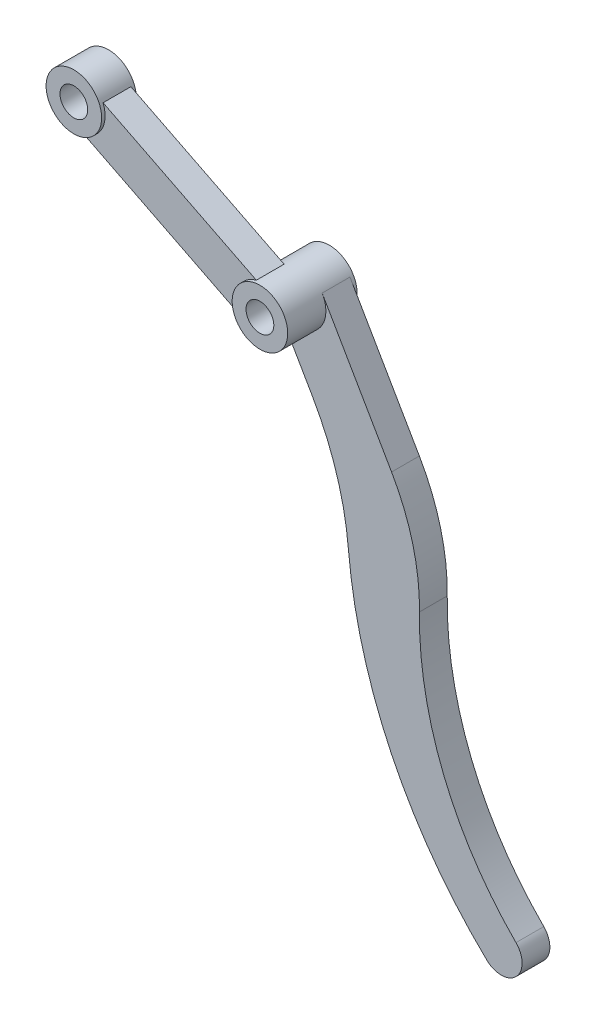
ISO-10303-21;
HEADER;
FILE_DESCRIPTION(('STEP AP214'),'2;1');
FILE_NAME('part.step','',(''),(''),'','','');
FILE_SCHEMA(('AUTOMOTIVE_DESIGN { 1 0 10303 214 1 1 1 1 }'));
ENDSEC;
DATA;
#1=APPLICATION_CONTEXT('core data for automotive mechanical design processes');
#2=APPLICATION_PROTOCOL_DEFINITION('international standard','automotive_design',2000,#1);
#3=PRODUCT_CONTEXT('',#1,'mechanical');
#4=PRODUCT('Part','Part','',(#3));
#5=PRODUCT_RELATED_PRODUCT_CATEGORY('part','',(#4));
#6=PRODUCT_DEFINITION_FORMATION('','',#4);
#7=PRODUCT_DEFINITION_CONTEXT('part definition',#1,'design');
#8=PRODUCT_DEFINITION('design','',#6,#7);
#9=PRODUCT_DEFINITION_SHAPE('','',#8);
#10=(LENGTH_UNIT() NAMED_UNIT(*) SI_UNIT(.MILLI.,.METRE.));
#11=(NAMED_UNIT(*) PLANE_ANGLE_UNIT() SI_UNIT($,.RADIAN.));
#12=(NAMED_UNIT(*) SI_UNIT($,.STERADIAN.) SOLID_ANGLE_UNIT());
#13=UNCERTAINTY_MEASURE_WITH_UNIT(LENGTH_MEASURE(1.E-05),#10,'distance_accuracy_value','');
#14=(GEOMETRIC_REPRESENTATION_CONTEXT(3) GLOBAL_UNCERTAINTY_ASSIGNED_CONTEXT((#13)) GLOBAL_UNIT_ASSIGNED_CONTEXT((#10,
#11,#12)) REPRESENTATION_CONTEXT('',''));
#15=CARTESIAN_POINT('',(0.,0.,0.));
#16=DIRECTION('',(0.,0.,1.));
#17=DIRECTION('',(1.,0.,0.));
#18=AXIS2_PLACEMENT_3D('',#15,#16,#17);
#19=CARTESIAN_POINT('',(0.,0.,10.));
#20=DIRECTION('',(0.,0.,-1.));
#21=DIRECTION('',(-1.,0.,0.));
#22=AXIS2_PLACEMENT_3D('',#19,#20,#21);
#23=CYLINDRICAL_SURFACE('',#22,8.);
#24=CARTESIAN_POINT('',(0.,0.,-10.));
#25=DIRECTION('',(0.,0.,1.));
#26=DIRECTION('',(1.,0.,0.));
#27=AXIS2_PLACEMENT_3D('',#24,#25,#26);
#28=CIRCLE('',#27,8.);
#29=CARTESIAN_POINT('',(8.,0.,-10.));
#30=VERTEX_POINT('',#29);
#31=EDGE_CURVE('E198',#30,#30,#28,.T.);
#32=ORIENTED_EDGE('',*,*,#31,.T.);
#33=EDGE_LOOP('',(#32));
#34=FACE_BOUND('',#33,.T.);
#35=CARTESIAN_POINT('',(0.,0.,10.));
#36=DIRECTION('',(0.,0.,1.));
#37=DIRECTION('',(1.,0.,0.));
#38=AXIS2_PLACEMENT_3D('',#35,#36,#37);
#39=CIRCLE('',#38,8.);
#40=CARTESIAN_POINT('',(8.,0.,10.));
#41=VERTEX_POINT('',#40);
#42=EDGE_CURVE('E11',#41,#41,#39,.T.);
#43=ORIENTED_EDGE('',*,*,#42,.F.);
#44=EDGE_LOOP('',(#43));
#45=FACE_BOUND('',#44,.T.);
#46=DIRECTION('',(0.,0.,-1.));
#47=VECTOR('',#46,1.);
#48=CARTESIAN_POINT('',(-2.03242078220373,7.73752323189187,9.));
#49=LINE('',#48,#47);
#50=CARTESIAN_POINT('',(-2.03242078220373,7.73752323189187,9.));
#51=VERTEX_POINT('',#50);
#52=CARTESIAN_POINT('',(-2.03242078220373,7.73752323189187,0.999999999999999));
#53=VERTEX_POINT('',#52);
#54=EDGE_CURVE('E57',#51,#53,#49,.T.);
#55=ORIENTED_EDGE('',*,*,#54,.F.);
#56=CARTESIAN_POINT('',(0.,0.,9.));
#57=DIRECTION('',(0.,0.,1.));
#58=DIRECTION('',(1.,0.,0.));
#59=AXIS2_PLACEMENT_3D('',#56,#57,#58);
#60=CIRCLE('',#59,8.);
#61=CARTESIAN_POINT('',(-7.42278324041352,-2.98367038491792,9.));
#62=VERTEX_POINT('',#61);
#63=EDGE_CURVE('E217',#51,#62,#60,.T.);
#64=ORIENTED_EDGE('',*,*,#63,.T.);
#65=DIRECTION('',(0.,0.,-1.));
#66=VECTOR('',#65,1.);
#67=CARTESIAN_POINT('',(-7.42278324041352,-2.98367038491791,9.));
#68=LINE('',#67,#66);
#69=CARTESIAN_POINT('',(-7.42278324041352,-2.98367038491791,1.));
#70=VERTEX_POINT('',#69);
#71=EDGE_CURVE('E240',#62,#70,#68,.T.);
#72=ORIENTED_EDGE('',*,*,#71,.T.);
#73=CARTESIAN_POINT('',(0.,0.,1.));
#74=DIRECTION('',(0.,0.,1.));
#75=DIRECTION('',(1.,0.,0.));
#76=AXIS2_PLACEMENT_3D('',#73,#74,#75);
#77=CIRCLE('',#76,8.);
#78=EDGE_CURVE('E227',#53,#70,#77,.T.);
#79=ORIENTED_EDGE('',*,*,#78,.F.);
#80=EDGE_LOOP('',(#55,#64,#72,#79));
#81=FACE_BOUND('',#80,.T.);
#82=CARTESIAN_POINT('',(0.,0.,-9.));
#83=DIRECTION('',(0.,0.,-1.));
#84=DIRECTION('',(1.,0.,0.));
#85=AXIS2_PLACEMENT_3D('',#82,#83,#84);
#86=CIRCLE('',#85,8.);
#87=CARTESIAN_POINT('',(6.9282032302755,4.00000000000001,-9.));
#88=VERTEX_POINT('',#87);
#89=CARTESIAN_POINT('',(-6.92820323027548,-4.00000000000006,-9.));
#90=VERTEX_POINT('',#89);
#91=EDGE_CURVE('E141',#88,#90,#86,.T.);
#92=ORIENTED_EDGE('',*,*,#91,.T.);
#93=DIRECTION('',(0.,0.,1.));
#94=VECTOR('',#93,1.);
#95=CARTESIAN_POINT('',(-6.92820323027548,-4.00000000000006,-9.));
#96=LINE('',#95,#94);
#97=CARTESIAN_POINT('',(-6.92820323027548,-4.00000000000006,-1.));
#98=VERTEX_POINT('',#97);
#99=EDGE_CURVE('E125',#90,#98,#96,.T.);
#100=ORIENTED_EDGE('',*,*,#99,.T.);
#101=CARTESIAN_POINT('',(0.,0.,-1.));
#102=DIRECTION('',(0.,0.,-1.));
#103=DIRECTION('',(1.,0.,0.));
#104=AXIS2_PLACEMENT_3D('',#101,#102,#103);
#105=CIRCLE('',#104,8.);
#106=CARTESIAN_POINT('',(6.9282032302755,4.00000000000001,-0.999999999999999));
#107=VERTEX_POINT('',#106);
#108=EDGE_CURVE('E167',#107,#98,#105,.T.);
#109=ORIENTED_EDGE('',*,*,#108,.F.);
#110=DIRECTION('',(0.,0.,1.));
#111=VECTOR('',#110,1.);
#112=CARTESIAN_POINT('',(6.9282032302755,4.00000000000001,-9.));
#113=LINE('',#112,#111);
#114=EDGE_CURVE('E148',#88,#107,#113,.T.);
#115=ORIENTED_EDGE('',*,*,#114,.F.);
#116=EDGE_LOOP('',(#92,#100,#109,#115));
#117=FACE_BOUND('',#116,.T.);
#118=ADVANCED_FACE('F35',(#34,#45,#81,#117),#23,.T.);
#119=CARTESIAN_POINT('',(0.,0.,10.));
#120=DIRECTION('',(0.,0.,1.));
#121=DIRECTION('',(1.,0.,0.));
#122=AXIS2_PLACEMENT_3D('',#119,#120,#121);
#123=PLANE('',#122);
#124=ORIENTED_EDGE('',*,*,#42,.T.);
#125=EDGE_LOOP('',(#124));
#126=FACE_BOUND('',#125,.T.);
#127=CARTESIAN_POINT('',(0.,0.,10.));
#128=DIRECTION('',(0.,0.,1.));
#129=DIRECTION('',(1.,0.,0.));
#130=AXIS2_PLACEMENT_3D('',#127,#128,#129);
#131=CIRCLE('',#130,4.);
#132=CARTESIAN_POINT('',(4.,0.,10.));
#133=VERTEX_POINT('',#132);
#134=EDGE_CURVE('E42',#133,#133,#131,.T.);
#135=ORIENTED_EDGE('',*,*,#134,.F.);
#136=EDGE_LOOP('',(#135));
#137=FACE_BOUND('',#136,.T.);
#138=ADVANCED_FACE('F248',(#126,#137),#123,.T.);
#139=CARTESIAN_POINT('',(0.,0.,10.));
#140=DIRECTION('',(0.,0.,-1.));
#141=DIRECTION('',(-1.,0.,0.));
#142=AXIS2_PLACEMENT_3D('',#139,#140,#141);
#143=CYLINDRICAL_SURFACE('',#142,4.);
#144=ORIENTED_EDGE('',*,*,#134,.T.);
#145=EDGE_LOOP('',(#144));
#146=FACE_BOUND('',#145,.T.);
#147=CARTESIAN_POINT('',(0.,0.,-10.));
#148=DIRECTION('',(0.,0.,1.));
#149=DIRECTION('',(1.,0.,0.));
#150=AXIS2_PLACEMENT_3D('',#147,#148,#149);
#151=CIRCLE('',#150,4.);
#152=CARTESIAN_POINT('',(4.,0.,-10.));
#153=VERTEX_POINT('',#152);
#154=EDGE_CURVE('E184',#153,#153,#151,.T.);
#155=ORIENTED_EDGE('',*,*,#154,.F.);
#156=EDGE_LOOP('',(#155));
#157=FACE_BOUND('',#156,.T.);
#158=ADVANCED_FACE('F245',(#146,#157),#143,.F.);
#159=CARTESIAN_POINT('',(-46.1831848436354,29.9354826759668,9.));
#160=DIRECTION('',(0.449196871517481,0.893432801400815,0.));
#161=DIRECTION('',(-0.893432801400815,0.449196871517481,0.));
#162=AXIS2_PLACEMENT_3D('',#159,#160,#161);
#163=PLANE('',#162);
#164=DIRECTION('',(0.893432801400815,-0.449196871517481,0.));
#165=VECTOR('',#164,1.);
#166=CARTESIAN_POINT('',(-46.1831848436354,29.9354826759668,1.));
#167=LINE('',#166,#165);
#168=CARTESIAN_POINT('',(-46.1831848436354,29.9354826759668,1.));
#169=VERTEX_POINT('',#168);
#170=EDGE_CURVE('E211',#169,#53,#167,.T.);
#171=ORIENTED_EDGE('',*,*,#170,.F.);
#172=DIRECTION('',(0.,0.,-1.));
#173=VECTOR('',#172,1.);
#174=CARTESIAN_POINT('',(-46.1831848436354,29.9354826759668,9.));
#175=LINE('',#174,#173);
#176=CARTESIAN_POINT('',(-46.1831848436354,29.9354826759668,9.));
#177=VERTEX_POINT('',#176);
#178=EDGE_CURVE('E235',#177,#169,#175,.T.);
#179=ORIENTED_EDGE('',*,*,#178,.F.);
#180=DIRECTION('',(0.893432801400815,-0.449196871517481,0.));
#181=VECTOR('',#180,1.);
#182=CARTESIAN_POINT('',(-46.1831848436354,29.9354826759668,9.));
#183=LINE('',#182,#181);
#184=EDGE_CURVE('E214',#177,#51,#183,.T.);
#185=ORIENTED_EDGE('',*,*,#184,.T.);
#186=ORIENTED_EDGE('',*,*,#54,.T.);
#187=EDGE_LOOP('',(#171,#179,#185,#186));
#188=FACE_BOUND('',#187,.T.);
#189=ADVANCED_FACE('F255',(#188),#163,.T.);
#190=CARTESIAN_POINT('',(-51.5735473018452,19.214289059157,9.));
#191=DIRECTION('',(0.449196871517481,0.893432801400815,0.));
#192=DIRECTION('',(-0.893432801400815,0.449196871517481,0.));
#193=AXIS2_PLACEMENT_3D('',#190,#191,#192);
#194=PLANE('',#193);
#195=DIRECTION('',(0.893432801400815,-0.449196871517481,0.));
#196=VECTOR('',#195,1.);
#197=CARTESIAN_POINT('',(-51.5735473018452,19.214289059157,1.));
#198=LINE('',#197,#196);
#199=CARTESIAN_POINT('',(-51.5735473018452,19.214289059157,0.999999999999999));
#200=VERTEX_POINT('',#199);
#201=EDGE_CURVE('E230',#200,#70,#198,.T.);
#202=ORIENTED_EDGE('',*,*,#201,.T.);
#203=ORIENTED_EDGE('',*,*,#71,.F.);
#204=DIRECTION('',(0.893432801400815,-0.449196871517481,0.));
#205=VECTOR('',#204,1.);
#206=CARTESIAN_POINT('',(-51.5735473018452,19.214289059157,9.));
#207=LINE('',#206,#205);
#208=CARTESIAN_POINT('',(-51.5735473018452,19.214289059157,9.));
#209=VERTEX_POINT('',#208);
#210=EDGE_CURVE('E220',#209,#62,#207,.T.);
#211=ORIENTED_EDGE('',*,*,#210,.F.);
#212=DIRECTION('',(0.,0.,-1.));
#213=VECTOR('',#212,1.);
#214=CARTESIAN_POINT('',(-51.5735473018452,19.214289059157,9.));
#215=LINE('',#214,#213);
#216=EDGE_CURVE('E237',#209,#200,#215,.T.);
#217=ORIENTED_EDGE('',*,*,#216,.T.);
#218=EDGE_LOOP('',(#202,#203,#211,#217));
#219=FACE_BOUND('',#218,.T.);
#220=ADVANCED_FACE('F261',(#219),#194,.F.);
#221=CARTESIAN_POINT('',(0.,0.,9.));
#222=DIRECTION('',(0.,0.,1.));
#223=DIRECTION('',(1.,0.,0.));
#224=AXIS2_PLACEMENT_3D('',#221,#222,#223);
#225=PLANE('',#224);
#226=ORIENTED_EDGE('',*,*,#184,.F.);
#227=CARTESIAN_POINT('',(-53.6059680840489,26.9518122910489,9.));
#228=DIRECTION('',(0.,0.,1.));
#229=DIRECTION('',(1.,0.,0.));
#230=AXIS2_PLACEMENT_3D('',#227,#228,#229);
#231=CIRCLE('',#230,8.);
#232=EDGE_CURVE('E223',#209,#177,#231,.T.);
#233=ORIENTED_EDGE('',*,*,#232,.F.);
#234=ORIENTED_EDGE('',*,*,#210,.T.);
#235=ORIENTED_EDGE('',*,*,#63,.F.);
#236=EDGE_LOOP('',(#226,#233,#234,#235));
#237=FACE_BOUND('',#236,.T.);
#238=ADVANCED_FACE('F265',(#237),#225,.T.);
#239=CARTESIAN_POINT('',(0.,0.,1.));
#240=DIRECTION('',(0.,0.,1.));
#241=DIRECTION('',(1.,0.,0.));
#242=AXIS2_PLACEMENT_3D('',#239,#240,#241);
#243=PLANE('',#242);
#244=ORIENTED_EDGE('',*,*,#170,.T.);
#245=ORIENTED_EDGE('',*,*,#78,.T.);
#246=ORIENTED_EDGE('',*,*,#201,.F.);
#247=CARTESIAN_POINT('',(-53.6059680840489,26.9518122910489,1.));
#248=DIRECTION('',(0.,0.,1.));
#249=DIRECTION('',(1.,0.,0.));
#250=AXIS2_PLACEMENT_3D('',#247,#248,#249);
#251=CIRCLE('',#250,8.);
#252=EDGE_CURVE('E218',#200,#169,#251,.T.);
#253=ORIENTED_EDGE('',*,*,#252,.T.);
#254=EDGE_LOOP('',(#244,#245,#246,#253));
#255=FACE_BOUND('',#254,.T.);
#256=ADVANCED_FACE('F267',(#255),#243,.F.);
#257=CARTESIAN_POINT('',(-53.6059680840489,26.9518122910489,10.));
#258=DIRECTION('',(0.,0.,1.));
#259=DIRECTION('',(1.,0.,0.));
#260=AXIS2_PLACEMENT_3D('',#257,#258,#259);
#261=PLANE('',#260);
#262=CARTESIAN_POINT('',(-53.6059680840489,26.9518122910489,10.));
#263=DIRECTION('',(0.,0.,1.));
#264=DIRECTION('',(1.,0.,0.));
#265=AXIS2_PLACEMENT_3D('',#262,#263,#264);
#266=CIRCLE('',#265,8.);
#267=CARTESIAN_POINT('',(-45.6059680840489,26.9518122910489,10.));
#268=VERTEX_POINT('',#267);
#269=EDGE_CURVE('E208',#268,#268,#266,.T.);
#270=ORIENTED_EDGE('',*,*,#269,.T.);
#271=EDGE_LOOP('',(#270));
#272=FACE_BOUND('',#271,.T.);
#273=CARTESIAN_POINT('',(-53.6059680840489,26.9518122910489,10.));
#274=DIRECTION('',(0.,0.,1.));
#275=DIRECTION('',(1.,0.,0.));
#276=AXIS2_PLACEMENT_3D('',#273,#274,#275);
#277=CIRCLE('',#276,4.);
#278=CARTESIAN_POINT('',(-49.6059680840489,26.9518122910489,10.));
#279=VERTEX_POINT('',#278);
#280=EDGE_CURVE('E202',#279,#279,#277,.T.);
#281=ORIENTED_EDGE('',*,*,#280,.F.);
#282=EDGE_LOOP('',(#281));
#283=FACE_BOUND('',#282,.T.);
#284=ADVANCED_FACE('F270',(#272,#283),#261,.T.);
#285=CARTESIAN_POINT('',(-53.6059680840489,26.9518122910489,0.));
#286=DIRECTION('',(0.,0.,1.));
#287=DIRECTION('',(1.,0.,0.));
#288=AXIS2_PLACEMENT_3D('',#285,#286,#287);
#289=PLANE('',#288);
#290=CARTESIAN_POINT('',(-53.6059680840489,26.9518122910489,0.));
#291=DIRECTION('',(0.,0.,1.));
#292=DIRECTION('',(1.,0.,0.));
#293=AXIS2_PLACEMENT_3D('',#290,#291,#292);
#294=CIRCLE('',#293,8.);
#295=CARTESIAN_POINT('',(-45.6059680840489,26.9518122910489,0.));
#296=VERTEX_POINT('',#295);
#297=EDGE_CURVE('E205',#296,#296,#294,.T.);
#298=ORIENTED_EDGE('',*,*,#297,.F.);
#299=EDGE_LOOP('',(#298));
#300=FACE_BOUND('',#299,.T.);
#301=CARTESIAN_POINT('',(-53.6059680840489,26.9518122910489,0.));
#302=DIRECTION('',(0.,0.,1.));
#303=DIRECTION('',(1.,0.,0.));
#304=AXIS2_PLACEMENT_3D('',#301,#302,#303);
#305=CIRCLE('',#304,4.);
#306=CARTESIAN_POINT('',(-49.6059680840489,26.9518122910489,0.));
#307=VERTEX_POINT('',#306);
#308=EDGE_CURVE('E201',#307,#307,#305,.T.);
#309=ORIENTED_EDGE('',*,*,#308,.T.);
#310=EDGE_LOOP('',(#309));
#311=FACE_BOUND('',#310,.T.);
#312=ADVANCED_FACE('F279',(#300,#311),#289,.F.);
#313=CARTESIAN_POINT('',(-53.6059680840489,26.9518122910489,10.));
#314=DIRECTION('',(0.,0.,-1.));
#315=DIRECTION('',(-1.,0.,0.));
#316=AXIS2_PLACEMENT_3D('',#313,#314,#315);
#317=CYLINDRICAL_SURFACE('',#316,8.);
#318=ORIENTED_EDGE('',*,*,#232,.T.);
#319=ORIENTED_EDGE('',*,*,#178,.T.);
#320=ORIENTED_EDGE('',*,*,#252,.F.);
#321=ORIENTED_EDGE('',*,*,#216,.F.);
#322=EDGE_LOOP('',(#318,#319,#320,#321));
#323=FACE_BOUND('',#322,.T.);
#324=ORIENTED_EDGE('',*,*,#269,.F.);
#325=EDGE_LOOP('',(#324));
#326=FACE_BOUND('',#325,.T.);
#327=ORIENTED_EDGE('',*,*,#297,.T.);
#328=EDGE_LOOP('',(#327));
#329=FACE_BOUND('',#328,.T.);
#330=ADVANCED_FACE('F275',(#323,#326,#329),#317,.T.);
#331=CARTESIAN_POINT('',(-53.6059680840489,26.9518122910489,10.));
#332=DIRECTION('',(0.,0.,-1.));
#333=DIRECTION('',(-1.,0.,0.));
#334=AXIS2_PLACEMENT_3D('',#331,#332,#333);
#335=CYLINDRICAL_SURFACE('',#334,4.);
#336=ORIENTED_EDGE('',*,*,#280,.T.);
#337=EDGE_LOOP('',(#336));
#338=FACE_BOUND('',#337,.T.);
#339=ORIENTED_EDGE('',*,*,#308,.F.);
#340=EDGE_LOOP('',(#339));
#341=FACE_BOUND('',#340,.T.);
#342=ADVANCED_FACE('F278',(#338,#341),#335,.F.);
#343=CARTESIAN_POINT('',(0.,0.,-10.));
#344=DIRECTION('',(0.,0.,1.));
#345=DIRECTION('',(1.,0.,0.));
#346=AXIS2_PLACEMENT_3D('',#343,#344,#345);
#347=PLANE('',#346);
#348=ORIENTED_EDGE('',*,*,#154,.T.);
#349=EDGE_LOOP('',(#348));
#350=FACE_BOUND('',#349,.T.);
#351=ORIENTED_EDGE('',*,*,#31,.F.);
#352=EDGE_LOOP('',(#351));
#353=FACE_BOUND('',#352,.T.);
#354=ADVANCED_FACE('F289',(#350,#353),#347,.F.);
#355=CARTESIAN_POINT('',(6.9282032302755,4.00000000000001,-9.));
#356=DIRECTION('',(0.866025403784438,0.500000000000001,0.));
#357=DIRECTION('',(-0.500000000000001,0.866025403784438,0.));
#358=AXIS2_PLACEMENT_3D('',#355,#356,#357);
#359=PLANE('',#358);
#360=DIRECTION('',(-0.500000000000001,0.866025403784438,0.));
#361=VECTOR('',#360,1.);
#362=CARTESIAN_POINT('',(6.9282032302755,4.00000000000001,-1.));
#363=LINE('',#362,#361);
#364=CARTESIAN_POINT('',(26.9282032302756,-30.6410161513775,-1.));
#365=VERTEX_POINT('',#364);
#366=EDGE_CURVE('E49',#365,#107,#363,.T.);
#367=ORIENTED_EDGE('',*,*,#366,.F.);
#368=DIRECTION('',(0.,0.,1.));
#369=VECTOR('',#368,1.);
#370=CARTESIAN_POINT('',(26.9282032302756,-30.6410161513775,-9.));
#371=LINE('',#370,#369);
#372=CARTESIAN_POINT('',(26.9282032302756,-30.6410161513775,-9.));
#373=VERTEX_POINT('',#372);
#374=EDGE_CURVE('E185',#373,#365,#371,.T.);
#375=ORIENTED_EDGE('',*,*,#374,.F.);
#376=DIRECTION('',(-0.500000000000001,0.866025403784438,0.));
#377=VECTOR('',#376,1.);
#378=CARTESIAN_POINT('',(6.9282032302755,4.00000000000001,-9.));
#379=LINE('',#378,#377);
#380=EDGE_CURVE('E135',#373,#88,#379,.T.);
#381=ORIENTED_EDGE('',*,*,#380,.T.);
#382=ORIENTED_EDGE('',*,*,#114,.T.);
#383=EDGE_LOOP('',(#367,#375,#381,#382));
#384=FACE_BOUND('',#383,.T.);
#385=ADVANCED_FACE('F293',(#384),#359,.T.);
#386=CARTESIAN_POINT('',(-25.0333209967907,-60.6410161513776,-9.));
#387=DIRECTION('',(0.,0.,1.));
#388=DIRECTION('',(1.,0.,0.));
#389=AXIS2_PLACEMENT_3D('',#386,#387,#388);
#390=CYLINDRICAL_SURFACE('',#389,60.);
#391=CARTESIAN_POINT('',(-25.0333209967907,-60.6410161513776,-1.));
#392=DIRECTION('',(0.,0.,1.));
#393=DIRECTION('',(1.,0.,0.));
#394=AXIS2_PLACEMENT_3D('',#391,#392,#393);
#395=CIRCLE('',#394,60.);
#396=CARTESIAN_POINT('',(34.9599609828741,-61.5388565093587,-1.));
#397=VERTEX_POINT('',#396);
#398=EDGE_CURVE('E150',#397,#365,#395,.T.);
#399=ORIENTED_EDGE('',*,*,#398,.F.);
#400=DIRECTION('',(0.,0.,1.));
#401=VECTOR('',#400,1.);
#402=CARTESIAN_POINT('',(34.9599609828741,-61.5388565093587,-9.));
#403=LINE('',#402,#401);
#404=CARTESIAN_POINT('',(34.9599609828741,-61.5388565093587,-9.));
#405=VERTEX_POINT('',#404);
#406=EDGE_CURVE('E187',#405,#397,#403,.T.);
#407=ORIENTED_EDGE('',*,*,#406,.F.);
#408=CARTESIAN_POINT('',(-25.0333209967907,-60.6410161513776,-9.));
#409=DIRECTION('',(0.,0.,1.));
#410=DIRECTION('',(1.,0.,0.));
#411=AXIS2_PLACEMENT_3D('',#408,#409,#410);
#412=CIRCLE('',#411,60.);
#413=EDGE_CURVE('E163',#405,#373,#412,.T.);
#414=ORIENTED_EDGE('',*,*,#413,.T.);
#415=ORIENTED_EDGE('',*,*,#374,.T.);
#416=EDGE_LOOP('',(#399,#407,#414,#415));
#417=FACE_BOUND('',#416,.T.);
#418=ADVANCED_FACE('F312',(#417),#390,.T.);
#419=CARTESIAN_POINT('',(129.949324117344,-62.9604370761623,-9.));
#420=DIRECTION('',(0.,0.,1.));
#421=DIRECTION('',(1.,0.,0.));
#422=AXIS2_PLACEMENT_3D('',#419,#420,#421);
#423=CYLINDRICAL_SURFACE('',#422,95.);
#424=CARTESIAN_POINT('',(129.949324117344,-62.9604370761623,-1.));
#425=DIRECTION('',(0.,0.,-1.));
#426=DIRECTION('',(-1.,0.,0.));
#427=AXIS2_PLACEMENT_3D('',#424,#425,#426);
#428=CIRCLE('',#427,95.);
#429=CARTESIAN_POINT('',(62.7741799046214,-130.135581288884,-1.));
#430=VERTEX_POINT('',#429);
#431=EDGE_CURVE('E179',#430,#397,#428,.T.);
#432=ORIENTED_EDGE('',*,*,#431,.F.);
#433=DIRECTION('',(0.,0.,1.));
#434=VECTOR('',#433,1.);
#435=CARTESIAN_POINT('',(62.7741799046214,-130.135581288884,-9.));
#436=LINE('',#435,#434);
#437=CARTESIAN_POINT('',(62.7741799046214,-130.135581288884,-9.));
#438=VERTEX_POINT('',#437);
#439=EDGE_CURVE('E189',#438,#430,#436,.T.);
#440=ORIENTED_EDGE('',*,*,#439,.F.);
#441=CARTESIAN_POINT('',(129.949324117344,-62.9604370761623,-9.));
#442=DIRECTION('',(0.,0.,-1.));
#443=DIRECTION('',(-1.,0.,0.));
#444=AXIS2_PLACEMENT_3D('',#441,#442,#443);
#445=CIRCLE('',#444,95.);
#446=EDGE_CURVE('E160',#438,#405,#445,.T.);
#447=ORIENTED_EDGE('',*,*,#446,.T.);
#448=ORIENTED_EDGE('',*,*,#406,.T.);
#449=EDGE_LOOP('',(#432,#440,#447,#448));
#450=FACE_BOUND('',#449,.T.);
#451=ADVANCED_FACE('F308',(#450),#423,.F.);
#452=CARTESIAN_POINT('',(58.5315392175021,-134.378221976003,-9.));
#453=DIRECTION('',(0.,0.,1.));
#454=DIRECTION('',(1.,0.,0.));
#455=AXIS2_PLACEMENT_3D('',#452,#453,#454);
#456=CYLINDRICAL_SURFACE('',#455,6.00000000000001);
#457=CARTESIAN_POINT('',(58.5315392175021,-134.378221976003,-1.));
#458=DIRECTION('',(0.,0.,1.));
#459=DIRECTION('',(1.,0.,0.));
#460=AXIS2_PLACEMENT_3D('',#457,#458,#459);
#461=CIRCLE('',#460,6.00000000000001);
#462=CARTESIAN_POINT('',(54.3974443559804,-138.726699833362,-1.));
#463=VERTEX_POINT('',#462);
#464=EDGE_CURVE('E176',#463,#430,#461,.T.);
#465=ORIENTED_EDGE('',*,*,#464,.F.);
#466=DIRECTION('',(0.,0.,1.));
#467=VECTOR('',#466,1.);
#468=CARTESIAN_POINT('',(54.3974443559804,-138.726699833362,-9.));
#469=LINE('',#468,#467);
#470=CARTESIAN_POINT('',(54.3974443559804,-138.726699833362,-9.));
#471=VERTEX_POINT('',#470);
#472=EDGE_CURVE('E191',#471,#463,#469,.T.);
#473=ORIENTED_EDGE('',*,*,#472,.F.);
#474=CARTESIAN_POINT('',(58.5315392175021,-134.378221976003,-9.));
#475=DIRECTION('',(0.,0.,1.));
#476=DIRECTION('',(1.,0.,0.));
#477=AXIS2_PLACEMENT_3D('',#474,#475,#476);
#478=CIRCLE('',#477,6.00000000000001);
#479=EDGE_CURVE('E157',#471,#438,#478,.T.);
#480=ORIENTED_EDGE('',*,*,#479,.T.);
#481=ORIENTED_EDGE('',*,*,#439,.T.);
#482=EDGE_LOOP('',(#465,#473,#480,#481));
#483=FACE_BOUND('',#482,.T.);
#484=ADVANCED_FACE('F304',(#483),#456,.T.);
#485=CARTESIAN_POINT('',(143.969499688949,-44.5096795905865,-9.));
#486=DIRECTION('',(0.,0.,1.));
#487=DIRECTION('',(1.,0.,0.));
#488=AXIS2_PLACEMENT_3D('',#485,#486,#487);
#489=CYLINDRICAL_SURFACE('',#488,130.);
#490=CARTESIAN_POINT('',(143.969499688949,-44.5096795905865,-1.));
#491=DIRECTION('',(0.,0.,1.));
#492=DIRECTION('',(1.,0.,0.));
#493=AXIS2_PLACEMENT_3D('',#490,#491,#492);
#494=CIRCLE('',#493,130.);
#495=CARTESIAN_POINT('',(14.4772826467712,-55.988604867002,-1.));
#496=VERTEX_POINT('',#495);
#497=EDGE_CURVE('E173',#496,#463,#494,.T.);
#498=ORIENTED_EDGE('',*,*,#497,.F.);
#499=DIRECTION('',(0.,0.,1.));
#500=VECTOR('',#499,1.);
#501=CARTESIAN_POINT('',(14.4772826467712,-55.988604867002,-9.));
#502=LINE('',#501,#500);
#503=CARTESIAN_POINT('',(14.4772826467712,-55.988604867002,-9.));
#504=VERTEX_POINT('',#503);
#505=EDGE_CURVE('E193',#504,#496,#502,.T.);
#506=ORIENTED_EDGE('',*,*,#505,.F.);
#507=CARTESIAN_POINT('',(143.969499688949,-44.5096795905865,-9.));
#508=DIRECTION('',(0.,0.,1.));
#509=DIRECTION('',(1.,0.,0.));
#510=AXIS2_PLACEMENT_3D('',#507,#508,#509);
#511=CIRCLE('',#510,130.);
#512=EDGE_CURVE('E154',#504,#471,#511,.T.);
#513=ORIENTED_EDGE('',*,*,#512,.T.);
#514=ORIENTED_EDGE('',*,*,#472,.T.);
#515=EDGE_LOOP('',(#498,#506,#513,#514));
#516=FACE_BOUND('',#515,.T.);
#517=ADVANCED_FACE('F300',(#516),#489,.T.);
#518=CARTESIAN_POINT('',(-65.2102355330305,-63.0525588832578,-9.));
#519=DIRECTION('',(0.,0.,1.));
#520=DIRECTION('',(1.,0.,0.));
#521=AXIS2_PLACEMENT_3D('',#518,#519,#520);
#522=CYLINDRICAL_SURFACE('',#521,80.);
#523=CARTESIAN_POINT('',(-65.2102355330305,-63.0525588832578,-1.));
#524=DIRECTION('',(0.,0.,-1.));
#525=DIRECTION('',(-1.,0.,0.));
#526=AXIS2_PLACEMENT_3D('',#523,#524,#525);
#527=CIRCLE('',#526,80.);
#528=CARTESIAN_POINT('',(4.07179676972455,-23.0525588832577,-1.));
#529=VERTEX_POINT('',#528);
#530=EDGE_CURVE('E170',#529,#496,#527,.T.);
#531=ORIENTED_EDGE('',*,*,#530,.F.);
#532=DIRECTION('',(0.,0.,1.));
#533=VECTOR('',#532,1.);
#534=CARTESIAN_POINT('',(4.07179676972455,-23.0525588832577,-9.));
#535=LINE('',#534,#533);
#536=CARTESIAN_POINT('',(4.07179676972455,-23.0525588832577,-9.));
#537=VERTEX_POINT('',#536);
#538=EDGE_CURVE('E134',#537,#529,#535,.T.);
#539=ORIENTED_EDGE('',*,*,#538,.F.);
#540=CARTESIAN_POINT('',(-65.2102355330305,-63.0525588832578,-9.));
#541=DIRECTION('',(0.,0.,-1.));
#542=DIRECTION('',(-1.,0.,0.));
#543=AXIS2_PLACEMENT_3D('',#540,#541,#542);
#544=CIRCLE('',#543,80.);
#545=EDGE_CURVE('E145',#537,#504,#544,.T.);
#546=ORIENTED_EDGE('',*,*,#545,.T.);
#547=ORIENTED_EDGE('',*,*,#505,.T.);
#548=EDGE_LOOP('',(#531,#539,#546,#547));
#549=FACE_BOUND('',#548,.T.);
#550=ADVANCED_FACE('F297',(#549),#522,.F.);
#551=CARTESIAN_POINT('',(-6.92820323027548,-4.00000000000006,-9.));
#552=DIRECTION('',(-0.866025403784438,-0.500000000000001,0.));
#553=DIRECTION('',(0.500000000000001,-0.866025403784438,0.));
#554=AXIS2_PLACEMENT_3D('',#551,#552,#553);
#555=PLANE('',#554);
#556=DIRECTION('',(0.500000000000001,-0.866025403784438,0.));
#557=VECTOR('',#556,1.);
#558=CARTESIAN_POINT('',(-6.92820323027548,-4.00000000000006,-1.));
#559=LINE('',#558,#557);
#560=EDGE_CURVE('E130',#98,#529,#559,.T.);
#561=ORIENTED_EDGE('',*,*,#560,.F.);
#562=ORIENTED_EDGE('',*,*,#99,.F.);
#563=DIRECTION('',(0.500000000000001,-0.866025403784438,0.));
#564=VECTOR('',#563,1.);
#565=CARTESIAN_POINT('',(-6.92820323027548,-4.00000000000006,-9.));
#566=LINE('',#565,#564);
#567=EDGE_CURVE('E128',#90,#537,#566,.T.);
#568=ORIENTED_EDGE('',*,*,#567,.T.);
#569=ORIENTED_EDGE('',*,*,#538,.T.);
#570=EDGE_LOOP('',(#561,#562,#568,#569));
#571=FACE_BOUND('',#570,.T.);
#572=ADVANCED_FACE('F127',(#571),#555,.T.);
#573=CARTESIAN_POINT('',(0.,0.,-9.));
#574=DIRECTION('',(0.,0.,1.));
#575=DIRECTION('',(1.,0.,0.));
#576=AXIS2_PLACEMENT_3D('',#573,#574,#575);
#577=PLANE('',#576);
#578=ORIENTED_EDGE('',*,*,#91,.F.);
#579=ORIENTED_EDGE('',*,*,#380,.F.);
#580=ORIENTED_EDGE('',*,*,#413,.F.);
#581=ORIENTED_EDGE('',*,*,#446,.F.);
#582=ORIENTED_EDGE('',*,*,#479,.F.);
#583=ORIENTED_EDGE('',*,*,#512,.F.);
#584=ORIENTED_EDGE('',*,*,#545,.F.);
#585=ORIENTED_EDGE('',*,*,#567,.F.);
#586=EDGE_LOOP('',(#578,#579,#580,#581,#582,#583,#584,#585));
#587=FACE_BOUND('',#586,.T.);
#588=ADVANCED_FACE('F139',(#587),#577,.F.);
#589=CARTESIAN_POINT('',(0.,0.,-1.));
#590=DIRECTION('',(0.,0.,1.));
#591=DIRECTION('',(1.,0.,0.));
#592=AXIS2_PLACEMENT_3D('',#589,#590,#591);
#593=PLANE('',#592);
#594=ORIENTED_EDGE('',*,*,#108,.T.);
#595=ORIENTED_EDGE('',*,*,#560,.T.);
#596=ORIENTED_EDGE('',*,*,#530,.T.);
#597=ORIENTED_EDGE('',*,*,#497,.T.);
#598=ORIENTED_EDGE('',*,*,#464,.T.);
#599=ORIENTED_EDGE('',*,*,#431,.T.);
#600=ORIENTED_EDGE('',*,*,#398,.T.);
#601=ORIENTED_EDGE('',*,*,#366,.T.);
#602=EDGE_LOOP('',(#594,#595,#596,#597,#598,#599,#600,#601));
#603=FACE_BOUND('',#602,.T.);
#604=ADVANCED_FACE('F320',(#603),#593,.T.);
#605=CLOSED_SHELL('',(#118,#138,#158,#189,#220,#238,#256,#284,#312,#330,#342,#354,#385,#418,
#451,#484,#517,#550,#572,#588,#604));
#606=MANIFOLD_SOLID_BREP('B2',#605);
#607=ADVANCED_BREP_SHAPE_REPRESENTATION('',(#18,#606),#14);
#608=SHAPE_DEFINITION_REPRESENTATION(#9,#607);
ENDSEC;
END-ISO-10303-21;
